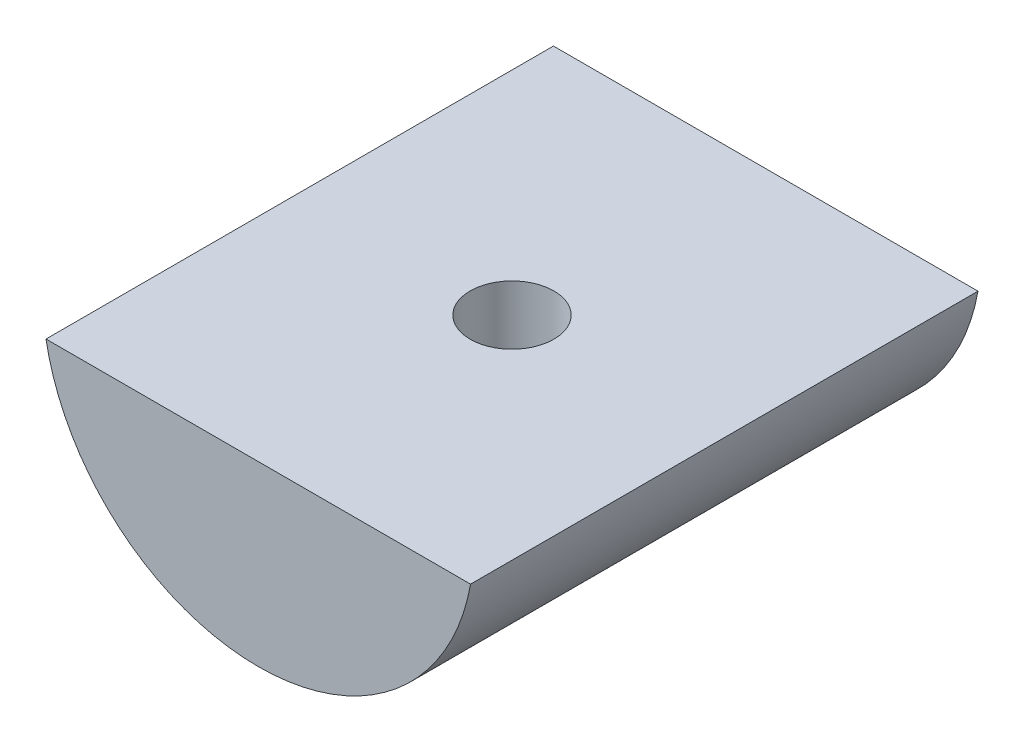
ISO-10303-21;
HEADER;
FILE_DESCRIPTION(('STEP AP214'),'2;1');
FILE_NAME('part.step','',(''),(''),'','','');
FILE_SCHEMA(('AUTOMOTIVE_DESIGN { 1 0 10303 214 1 1 1 1 }'));
ENDSEC;
DATA;
#1=APPLICATION_CONTEXT('core data for automotive mechanical design processes');
#2=APPLICATION_PROTOCOL_DEFINITION('international standard','automotive_design',2000,#1);
#3=PRODUCT_CONTEXT('',#1,'mechanical');
#4=PRODUCT('Part','Part','',(#3));
#5=PRODUCT_RELATED_PRODUCT_CATEGORY('part','',(#4));
#6=PRODUCT_DEFINITION_FORMATION('','',#4);
#7=PRODUCT_DEFINITION_CONTEXT('part definition',#1,'design');
#8=PRODUCT_DEFINITION('design','',#6,#7);
#9=PRODUCT_DEFINITION_SHAPE('','',#8);
#10=(LENGTH_UNIT() NAMED_UNIT(*) SI_UNIT(.MILLI.,.METRE.));
#11=(NAMED_UNIT(*) PLANE_ANGLE_UNIT() SI_UNIT($,.RADIAN.));
#12=(NAMED_UNIT(*) SI_UNIT($,.STERADIAN.) SOLID_ANGLE_UNIT());
#13=UNCERTAINTY_MEASURE_WITH_UNIT(LENGTH_MEASURE(1.E-05),#10,'distance_accuracy_value','');
#14=(GEOMETRIC_REPRESENTATION_CONTEXT(3) GLOBAL_UNCERTAINTY_ASSIGNED_CONTEXT((#13)) GLOBAL_UNIT_ASSIGNED_CONTEXT((#10,
#11,#12)) REPRESENTATION_CONTEXT('',''));
#15=CARTESIAN_POINT('',(0.,0.,0.));
#16=DIRECTION('',(0.,0.,1.));
#17=DIRECTION('',(1.,0.,0.));
#18=AXIS2_PLACEMENT_3D('',#15,#16,#17);
#19=CARTESIAN_POINT('',(0.,0.,20.));
#20=DIRECTION('',(0.,0.,-1.));
#21=DIRECTION('',(-1.,0.,0.));
#22=AXIS2_PLACEMENT_3D('',#19,#20,#21);
#23=CYLINDRICAL_SURFACE('',#22,8.5);
#24=CARTESIAN_POINT('',(0.,-8.5,11.65));
#25=CARTESIAN_POINT('',(0.0917578548761727,-8.49999832025719,11.6499965602042));
#26=CARTESIAN_POINT('',(0.183559795009382,-8.49849891201153,11.6423200422062));
#27=CARTESIAN_POINT('',(0.364572606900442,-8.49266205192729,11.6118389717125));
#28=CARTESIAN_POINT('',(0.453781296438243,-8.48832227822841,11.5890220424572));
#29=CARTESIAN_POINT('',(0.626963957483874,-8.47728969709361,11.5289884941571));
#30=CARTESIAN_POINT('',(0.71094272199686,-8.47059908260546,11.4917852918976));
#31=CARTESIAN_POINT('',(0.87145966489412,-8.45559371686794,11.4040742844069));
#32=CARTESIAN_POINT('',(0.9479983616763,-8.44727907889651,11.3535674070402));
#33=CARTESIAN_POINT('',(1.09244852370677,-8.42982308271023,11.2399972426233));
#34=CARTESIAN_POINT('',(1.16025105623873,-8.42067334147831,11.1767966783299));
#35=CARTESIAN_POINT('',(1.28436139856173,-8.40263994550878,11.039928371368));
#36=CARTESIAN_POINT('',(1.34066834567172,-8.39375631078367,10.966259843839));
#37=CARTESIAN_POINT('',(1.44064777839138,-8.37717929107626,10.809769777025));
#38=CARTESIAN_POINT('',(1.48420841654181,-8.36949670318931,10.7268755351919));
#39=CARTESIAN_POINT('',(1.55674242572275,-8.35631024255363,10.5547710523354));
#40=CARTESIAN_POINT('',(1.58571714979593,-8.3508061677282,10.4655613980287));
#41=CARTESIAN_POINT('',(1.62790512961129,-8.34268453377063,10.2845273883385));
#42=CARTESIAN_POINT('',(1.64130896378251,-8.34003210285188,10.1927490410743));
#43=CARTESIAN_POINT('',(1.65256643723148,-8.3378090305464,10.0082107631364));
#44=CARTESIAN_POINT('',(1.6504215726866,-8.33823809264221,9.91545092776433));
#45=CARTESIAN_POINT('',(1.63079683310598,-8.34209781281849,9.73297057586622));
#46=CARTESIAN_POINT('',(1.61353458448671,-8.34548587197185,9.6432256200437));
#47=CARTESIAN_POINT('',(1.56450822753314,-8.35481484087511,9.46793025128351));
#48=CARTESIAN_POINT('',(1.53274346301148,-8.36075586613694,9.38238002833659));
#49=CARTESIAN_POINT('',(1.45540355797959,-8.37456538389797,9.21727082639536));
#50=CARTESIAN_POINT('',(1.40974138709099,-8.38244596125393,9.13775366645394));
#51=CARTESIAN_POINT('',(1.30596432558801,-8.39923877195772,8.98742834703787));
#52=CARTESIAN_POINT('',(1.24784808366543,-8.40815111720752,8.91662113393477));
#53=CARTESIAN_POINT('',(1.11964348960822,-8.4261883264554,8.7844691244189));
#54=CARTESIAN_POINT('',(1.04936920257998,-8.43531423474582,8.72330470878368));
#55=CARTESIAN_POINT('',(0.899463278615004,-8.45261198378664,8.6136046130302));
#56=CARTESIAN_POINT('',(0.819831534635918,-8.46078381362097,8.56506907739737));
#57=CARTESIAN_POINT('',(0.653276624163655,-8.47527099090298,8.48197437605567));
#58=CARTESIAN_POINT('',(0.56634337158349,-8.48158371417175,8.44743494062747));
#59=CARTESIAN_POINT('',(0.38775869236084,-8.49162132362191,8.39350044273277));
#60=CARTESIAN_POINT('',(0.296107804829156,-8.4953465047943,8.37410365390786));
#61=CARTESIAN_POINT('',(0.112240426608544,-8.49974848974026,8.35125836989781));
#62=CARTESIAN_POINT('',(0.0200557190757641,-8.50047249989221,8.34756288056241));
#63=CARTESIAN_POINT('',(-0.163614152460132,-8.49892134154497,8.35556117753612));
#64=CARTESIAN_POINT('',(-0.255099353153598,-8.49664633145017,8.36725415104638));
#65=CARTESIAN_POINT('',(-0.433982863391036,-8.48938222630016,8.40549217583488));
#66=CARTESIAN_POINT('',(-0.521409100470817,-8.48441614716659,8.43191133249519));
#67=CARTESIAN_POINT('',(-0.690591045455613,-8.47232456703634,8.49871484756946));
#68=CARTESIAN_POINT('',(-0.772346346709194,-8.46519891137706,8.53910020623142));
#69=CARTESIAN_POINT('',(-0.928913312715197,-8.44946090104695,8.6332299598546));
#70=CARTESIAN_POINT('',(-1.00363326300589,-8.44083223449836,8.68712412038917));
#71=CARTESIAN_POINT('',(-1.14305740778948,-8.42308543513866,8.80654007524563));
#72=CARTESIAN_POINT('',(-1.20776059374859,-8.4139672531652,8.87206303898505));
#73=CARTESIAN_POINT('',(-1.32626076655338,-8.3961111738875,9.01399811880639));
#74=CARTESIAN_POINT('',(-1.37988866343742,-8.38738057421412,9.09055248041187));
#75=CARTESIAN_POINT('',(-1.47352438880316,-8.37143901310791,9.25172801575305));
#76=CARTESIAN_POINT('',(-1.51353274470931,-8.36422799283261,9.3363488769465));
#77=CARTESIAN_POINT('',(-1.57855858246202,-8.35220018952742,9.51084087861686));
#78=CARTESIAN_POINT('',(-1.6036512970161,-8.34737141211243,9.60068311718083));
#79=CARTESIAN_POINT('',(-1.63836363568784,-8.34062844409999,9.78341171423486));
#80=CARTESIAN_POINT('',(-1.64798514645237,-8.33871389812604,9.87629770014318));
#81=CARTESIAN_POINT('',(-1.65141531863407,-8.33803508421277,10.0607813383104));
#82=CARTESIAN_POINT('',(-1.64549094031535,-8.3392176310747,10.1523739364795));
#83=CARTESIAN_POINT('',(-1.61858443677707,-8.34448135784571,10.3332307717614));
#84=CARTESIAN_POINT('',(-1.59760241729325,-8.34856251740054,10.4224950252195));
#85=CARTESIAN_POINT('',(-1.54129226462489,-8.35914050277268,10.5960039724302));
#86=CARTESIAN_POINT('',(-1.50599504067702,-8.36563212141858,10.680259035369));
#87=CARTESIAN_POINT('',(-1.42208637021179,-8.38030288562149,10.8416934118121));
#88=CARTESIAN_POINT('',(-1.37347389059615,-8.38848216210763,10.9188721756631));
#89=CARTESIAN_POINT('',(-1.26339503538183,-8.40577050885017,11.0652962607894));
#90=CARTESIAN_POINT('',(-1.20173514721014,-8.41489237935345,11.1343946174793));
#91=CARTESIAN_POINT('',(-1.06771324468479,-8.43294439550503,11.2613524469619));
#92=CARTESIAN_POINT('',(-0.995348775375916,-8.44187449663413,11.3192093346109));
#93=CARTESIAN_POINT('',(-0.841124522574992,-8.45863929074361,11.4225723241656));
#94=CARTESIAN_POINT('',(-0.759178980783338,-8.46646244544643,11.4679524089529));
#95=CARTESIAN_POINT('',(-0.58869858580354,-8.4800187857976,11.544227215313));
#96=CARTESIAN_POINT('',(-0.500169879087721,-8.48575389219867,11.5751352569473));
#97=CARTESIAN_POINT('',(-0.342843706265226,-8.49334735640045,11.6154636641424));
#98=CARTESIAN_POINT('',(-0.274953675143933,-8.49582774350452,11.628392160238));
#99=CARTESIAN_POINT('',(-0.138050726633229,-8.49915467379275,11.6456614990858));
#100=CARTESIAN_POINT('',(-0.0690378414977752,-8.50000126382443,11.6500025880736));
#101=CARTESIAN_POINT('',(0.,-8.5,11.65));
#102=B_SPLINE_CURVE_WITH_KNOTS('',3,(#24,#25,#26,#27,#28,#29,#30,#31,#32,#33,#34,#35,#36,#37,
#38,#39,#40,#41,#42,#43,#44,#45,#46,#47,#48,#49,#50,#51,#52,#53,#54,#55,#56,#57,#58,#59,#60,#61,
#62,#63,#64,#65,#66,#67,#68,#69,#70,#71,#72,#73,#74,#75,#76,#77,#78,#79,#80,#81,#82,#83,#84,#85,
#86,#87,#88,#89,#90,#91,#92,#93,#94,#95,#96,#97,#98,#99,#100,#101),.UNSPECIFIED.,.T.,.F.,(4,2,2,
2,2,2,2,2,2,2,2,2,2,2,2,2,2,2,2,2,2,2,2,2,2,2,2,2,2,2,2,2,2,2,2,2,2,2,4),(0.,0.275021044609913,
0.550267186780406,0.825257248276735,1.10022813567252,1.37835052564128,1.65649377951402,
1.93700915666432,2.21749850738631,2.49451740896379,2.77150965468309,3.04457874366191,
3.3176601892722,3.59248823676245,3.86734611912355,4.14685472537643,4.42636652931125,
4.70627100119433,4.98614355751792,5.26159680425811,5.53703550249549,5.81015480312156,
6.08329366838162,6.35960611214583,6.63594635824592,6.91623610700702,7.19651500015372,
7.4753679329529,7.75418685825466,8.02824925273172,8.30230972274371,8.5757815682854,
8.84927463785543,9.12715073905731,9.40509066658125,9.68574250719844,9.96613552575269,
10.1730649898857,10.379988520432),.UNSPECIFIED.);
#103=CARTESIAN_POINT('',(0.,-8.5,11.65));
#104=VERTEX_POINT('',#103);
#105=EDGE_CURVE('E72',#104,#104,#102,.T.);
#106=ORIENTED_EDGE('',*,*,#105,.T.);
#107=EDGE_LOOP('',(#106));
#108=FACE_BOUND('',#107,.T.);
#109=CARTESIAN_POINT('',(0.,0.,0.));
#110=DIRECTION('',(0.,0.,1.));
#111=DIRECTION('',(1.,0.,0.));
#112=AXIS2_PLACEMENT_3D('',#109,#110,#111);
#113=CIRCLE('',#112,8.5);
#114=CARTESIAN_POINT('',(-8.36660026534076,-1.5,0.));
#115=VERTEX_POINT('',#114);
#116=CARTESIAN_POINT('',(8.36660026534076,-1.5,0.));
#117=VERTEX_POINT('',#116);
#118=EDGE_CURVE('E68',#115,#117,#113,.T.);
#119=ORIENTED_EDGE('',*,*,#118,.T.);
#120=DIRECTION('',(0.,0.,-1.));
#121=VECTOR('',#120,1.);
#122=CARTESIAN_POINT('',(8.36660026534076,-1.5,20.));
#123=LINE('',#122,#121);
#124=CARTESIAN_POINT('',(8.36660026534076,-1.5,20.));
#125=VERTEX_POINT('',#124);
#126=EDGE_CURVE('E11',#125,#117,#123,.T.);
#127=ORIENTED_EDGE('',*,*,#126,.F.);
#128=CARTESIAN_POINT('',(0.,0.,20.));
#129=DIRECTION('',(0.,0.,1.));
#130=DIRECTION('',(1.,0.,0.));
#131=AXIS2_PLACEMENT_3D('',#128,#129,#130);
#132=CIRCLE('',#131,8.5);
#133=CARTESIAN_POINT('',(-8.36660026534076,-1.5,20.));
#134=VERTEX_POINT('',#133);
#135=EDGE_CURVE('E67',#134,#125,#132,.T.);
#136=ORIENTED_EDGE('',*,*,#135,.F.);
#137=DIRECTION('',(0.,0.,-1.));
#138=VECTOR('',#137,1.);
#139=CARTESIAN_POINT('',(-8.36660026534076,-1.5,20.));
#140=LINE('',#139,#138);
#141=EDGE_CURVE('E45',#134,#115,#140,.T.);
#142=ORIENTED_EDGE('',*,*,#141,.T.);
#143=EDGE_LOOP('',(#119,#127,#136,#142));
#144=FACE_BOUND('',#143,.T.);
#145=ADVANCED_FACE('F36',(#108,#144),#23,.T.);
#146=CARTESIAN_POINT('',(-8.36660026534076,-1.5,20.));
#147=DIRECTION('',(0.,-1.,0.));
#148=DIRECTION('',(0.,0.,-1.));
#149=AXIS2_PLACEMENT_3D('',#146,#147,#148);
#150=PLANE('',#149);
#151=CARTESIAN_POINT('',(0.,-1.5,10.));
#152=DIRECTION('',(0.,1.,0.));
#153=DIRECTION('',(0.,0.,1.));
#154=AXIS2_PLACEMENT_3D('',#151,#152,#153);
#155=CIRCLE('',#154,1.65);
#156=CARTESIAN_POINT('',(0.,-1.5,11.65));
#157=VERTEX_POINT('',#156);
#158=EDGE_CURVE('E75',#157,#157,#155,.T.);
#159=ORIENTED_EDGE('',*,*,#158,.F.);
#160=EDGE_LOOP('',(#159));
#161=FACE_BOUND('',#160,.T.);
#162=DIRECTION('',(-1.,0.,0.));
#163=VECTOR('',#162,1.);
#164=CARTESIAN_POINT('',(-8.36660026534076,-1.5,0.));
#165=LINE('',#164,#163);
#166=EDGE_CURVE('E60',#117,#115,#165,.T.);
#167=ORIENTED_EDGE('',*,*,#166,.T.);
#168=ORIENTED_EDGE('',*,*,#141,.F.);
#169=DIRECTION('',(-1.,0.,0.));
#170=VECTOR('',#169,1.);
#171=CARTESIAN_POINT('',(-8.36660026534076,-1.5,20.));
#172=LINE('',#171,#170);
#173=EDGE_CURVE('E52',#125,#134,#172,.T.);
#174=ORIENTED_EDGE('',*,*,#173,.F.);
#175=ORIENTED_EDGE('',*,*,#126,.T.);
#176=EDGE_LOOP('',(#167,#168,#174,#175));
#177=FACE_BOUND('',#176,.T.);
#178=ADVANCED_FACE('F63',(#161,#177),#150,.F.);
#179=CARTESIAN_POINT('',(0.,0.,20.));
#180=DIRECTION('',(0.,0.,1.));
#181=DIRECTION('',(1.,0.,0.));
#182=AXIS2_PLACEMENT_3D('',#179,#180,#181);
#183=PLANE('',#182);
#184=ORIENTED_EDGE('',*,*,#135,.T.);
#185=ORIENTED_EDGE('',*,*,#173,.T.);
#186=EDGE_LOOP('',(#184,#185));
#187=FACE_BOUND('',#186,.T.);
#188=ADVANCED_FACE('F89',(#187),#183,.T.);
#189=CARTESIAN_POINT('',(0.,0.,0.));
#190=DIRECTION('',(0.,0.,1.));
#191=DIRECTION('',(1.,0.,0.));
#192=AXIS2_PLACEMENT_3D('',#189,#190,#191);
#193=PLANE('',#192);
#194=ORIENTED_EDGE('',*,*,#118,.F.);
#195=ORIENTED_EDGE('',*,*,#166,.F.);
#196=EDGE_LOOP('',(#194,#195));
#197=FACE_BOUND('',#196,.T.);
#198=ADVANCED_FACE('F71',(#197),#193,.F.);
#199=CARTESIAN_POINT('',(0.,-8.5,10.));
#200=DIRECTION('',(0.,1.,0.));
#201=DIRECTION('',(0.,0.,1.));
#202=AXIS2_PLACEMENT_3D('',#199,#200,#201);
#203=CYLINDRICAL_SURFACE('',#202,1.65);
#204=ORIENTED_EDGE('',*,*,#158,.T.);
#205=EDGE_LOOP('',(#204));
#206=FACE_BOUND('',#205,.T.);
#207=ORIENTED_EDGE('',*,*,#105,.F.);
#208=EDGE_LOOP('',(#207));
#209=FACE_BOUND('',#208,.T.);
#210=ADVANCED_FACE('F84',(#206,#209),#203,.F.);
#211=CLOSED_SHELL('',(#145,#178,#188,#198,#210));
#212=MANIFOLD_SOLID_BREP('B2',#211);
#213=ADVANCED_BREP_SHAPE_REPRESENTATION('',(#18,#212),#14);
#214=SHAPE_DEFINITION_REPRESENTATION(#9,#213);
ENDSEC;
END-ISO-10303-21;
